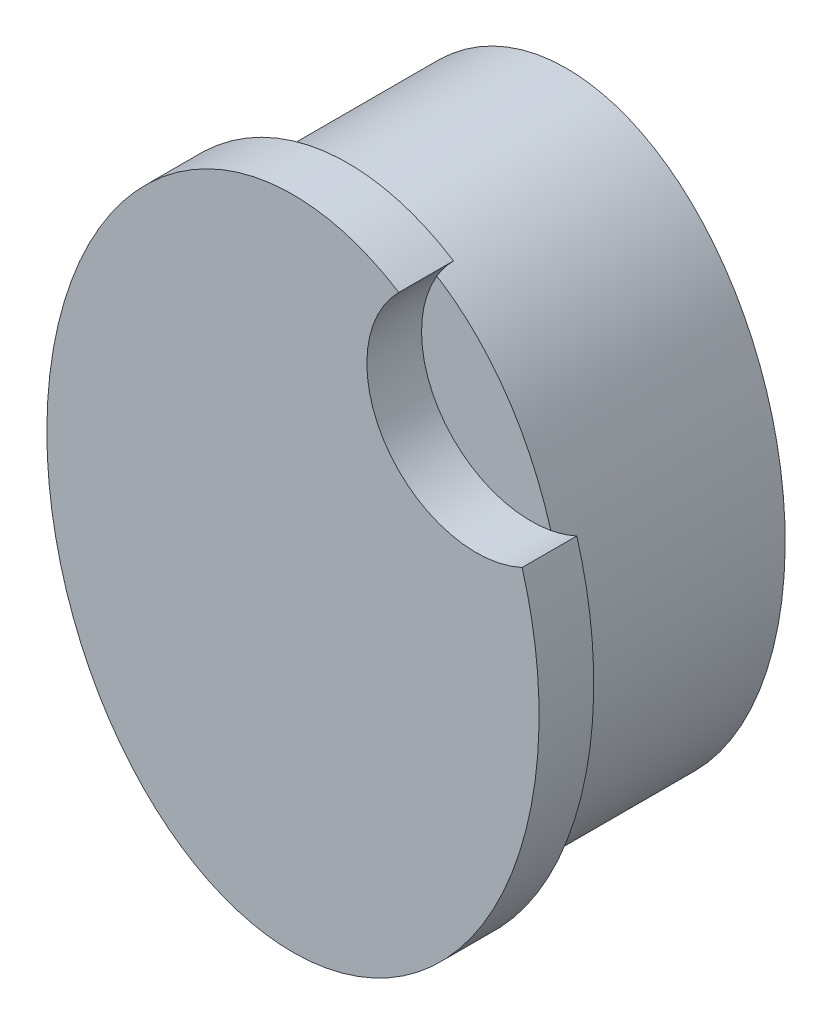
ISO-10303-21;
HEADER;
FILE_DESCRIPTION(('STEP AP214'),'2;1');
FILE_NAME('part.step','',(''),(''),'','','');
FILE_SCHEMA(('AUTOMOTIVE_DESIGN { 1 0 10303 214 1 1 1 1 }'));
ENDSEC;
DATA;
#1=APPLICATION_CONTEXT('core data for automotive mechanical design processes');
#2=APPLICATION_PROTOCOL_DEFINITION('international standard','automotive_design',2000,#1);
#3=PRODUCT_CONTEXT('',#1,'mechanical');
#4=PRODUCT('Part','Part','',(#3));
#5=PRODUCT_RELATED_PRODUCT_CATEGORY('part','',(#4));
#6=PRODUCT_DEFINITION_FORMATION('','',#4);
#7=PRODUCT_DEFINITION_CONTEXT('part definition',#1,'design');
#8=PRODUCT_DEFINITION('design','',#6,#7);
#9=PRODUCT_DEFINITION_SHAPE('','',#8);
#10=(LENGTH_UNIT() NAMED_UNIT(*) SI_UNIT(.MILLI.,.METRE.));
#11=(NAMED_UNIT(*) PLANE_ANGLE_UNIT() SI_UNIT($,.RADIAN.));
#12=(NAMED_UNIT(*) SI_UNIT($,.STERADIAN.) SOLID_ANGLE_UNIT());
#13=UNCERTAINTY_MEASURE_WITH_UNIT(LENGTH_MEASURE(1.E-05),#10,'distance_accuracy_value','');
#14=(GEOMETRIC_REPRESENTATION_CONTEXT(3) GLOBAL_UNCERTAINTY_ASSIGNED_CONTEXT((#13)) GLOBAL_UNIT_ASSIGNED_CONTEXT((#10,
#11,#12)) REPRESENTATION_CONTEXT('',''));
#15=CARTESIAN_POINT('',(0.,0.,0.));
#16=DIRECTION('',(0.,0.,1.));
#17=DIRECTION('',(1.,0.,0.));
#18=AXIS2_PLACEMENT_3D('',#15,#16,#17);
#19=CARTESIAN_POINT('',(0.,0.,8.));
#20=DIRECTION('',(0.,0.,1.));
#21=DIRECTION('',(0.,1.,0.));
#22=AXIS2_PLACEMENT_3D('',#19,#20,#21);
#23=ELLIPSE('',#22,11.,8.);
#24=DIRECTION('',(0.,0.,-1.));
#25=VECTOR('',#24,1.);
#26=SURFACE_OF_LINEAR_EXTRUSION('',#23,#25);
#27=CARTESIAN_POINT('',(7.43065525320684,4.0755154265035,8.));
#28=VERTEX_POINT('',#27);
#29=CARTESIAN_POINT('',(3.25976218449925,10.0454031857872,8.));
#30=VERTEX_POINT('',#29);
#31=EDGE_CURVE('E41',#28,#30,#23,.T.);
#32=ORIENTED_EDGE('',*,*,#31,.F.);
#33=EDGE_CURVE('E89',#30,#28,#23,.T.);
#34=ORIENTED_EDGE('',*,*,#33,.F.);
#35=EDGE_LOOP('',(#32,#34));
#36=FACE_BOUND('',#35,.T.);
#37=CARTESIAN_POINT('',(0.,0.,0.));
#38=DIRECTION('',(0.,0.,1.));
#39=DIRECTION('',(0.,1.,0.));
#40=AXIS2_PLACEMENT_3D('',#37,#38,#39);
#41=ELLIPSE('',#40,11.,8.);
#42=CARTESIAN_POINT('',(0.,11.,0.));
#43=VERTEX_POINT('',#42);
#44=EDGE_CURVE('E84',#43,#43,#41,.T.);
#45=ORIENTED_EDGE('',*,*,#44,.T.);
#46=EDGE_LOOP('',(#45));
#47=FACE_BOUND('',#46,.T.);
#48=ADVANCED_FACE('F33',(#36,#47),#26,.F.);
#49=CARTESIAN_POINT('',(0.,0.,0.));
#50=DIRECTION('',(0.,0.,1.));
#51=DIRECTION('',(1.,0.,0.));
#52=AXIS2_PLACEMENT_3D('',#49,#50,#51);
#53=PLANE('',#52);
#54=ORIENTED_EDGE('',*,*,#44,.F.);
#55=EDGE_LOOP('',(#54));
#56=FACE_BOUND('',#55,.T.);
#57=ADVANCED_FACE('F108',(#56),#53,.F.);
#58=CARTESIAN_POINT('',(0.,0.,10.));
#59=DIRECTION('',(0.,0.,1.));
#60=DIRECTION('',(0.,1.,0.));
#61=AXIS2_PLACEMENT_3D('',#58,#59,#60);
#62=ELLIPSE('',#61,12.,9.);
#63=DIRECTION('',(0.,0.,-1.));
#64=VECTOR('',#63,1.);
#65=SURFACE_OF_LINEAR_EXTRUSION('',#62,#64);
#66=CARTESIAN_POINT('',(0.,0.,8.));
#67=DIRECTION('',(0.,0.,1.));
#68=DIRECTION('',(0.,1.,0.));
#69=AXIS2_PLACEMENT_3D('',#66,#67,#68);
#70=ELLIPSE('',#69,12.,9.);
#71=CARTESIAN_POINT('',(3.870504693485,10.8336261226248,8.));
#72=VERTEX_POINT('',#71);
#73=CARTESIAN_POINT('',(8.37983667065646,4.37738376925381,8.));
#74=VERTEX_POINT('',#73);
#75=EDGE_CURVE('E78',#72,#74,#70,.T.);
#76=ORIENTED_EDGE('',*,*,#75,.T.);
#77=DIRECTION('',(0.,0.,1.));
#78=VECTOR('',#77,1.);
#79=CARTESIAN_POINT('',(8.37983667065646,4.37738376925381,8.));
#80=LINE('',#79,#78);
#81=CARTESIAN_POINT('',(8.37983667065646,4.37738376925381,10.));
#82=VERTEX_POINT('',#81);
#83=EDGE_CURVE('E48',#74,#82,#80,.T.);
#84=ORIENTED_EDGE('',*,*,#83,.T.);
#85=CARTESIAN_POINT('',(3.870504693485,10.8336261226248,10.));
#86=VERTEX_POINT('',#85);
#87=EDGE_CURVE('E80',#86,#82,#62,.T.);
#88=ORIENTED_EDGE('',*,*,#87,.F.);
#89=DIRECTION('',(0.,0.,1.));
#90=VECTOR('',#89,1.);
#91=CARTESIAN_POINT('',(3.870504693485,10.8336261226248,8.));
#92=LINE('',#91,#90);
#93=EDGE_CURVE('E66',#72,#86,#92,.T.);
#94=ORIENTED_EDGE('',*,*,#93,.F.);
#95=EDGE_LOOP('',(#76,#84,#88,#94));
#96=FACE_BOUND('',#95,.T.);
#97=ADVANCED_FACE('F77',(#96),#65,.F.);
#98=CARTESIAN_POINT('',(0.,0.,10.));
#99=DIRECTION('',(0.,0.,1.));
#100=DIRECTION('',(1.,0.,0.));
#101=AXIS2_PLACEMENT_3D('',#98,#99,#100);
#102=PLANE('',#101);
#103=CARTESIAN_POINT('',(6.70238881320191,8.00866022327396,10.));
#104=DIRECTION('',(0.,0.,1.));
#105=DIRECTION('',(1.,0.,0.));
#106=AXIS2_PLACEMENT_3D('',#103,#104,#105);
#107=CIRCLE('',#106,4.);
#108=EDGE_CURVE('E97',#86,#82,#107,.T.);
#109=ORIENTED_EDGE('',*,*,#108,.F.);
#110=ORIENTED_EDGE('',*,*,#87,.T.);
#111=EDGE_LOOP('',(#109,#110));
#112=FACE_BOUND('',#111,.T.);
#113=ADVANCED_FACE('F100',(#112),#102,.T.);
#114=CARTESIAN_POINT('',(0.,0.,8.));
#115=DIRECTION('',(0.,0.,1.));
#116=DIRECTION('',(1.,0.,0.));
#117=AXIS2_PLACEMENT_3D('',#114,#115,#116);
#118=PLANE('',#117);
#119=ORIENTED_EDGE('',*,*,#75,.F.);
#120=CARTESIAN_POINT('',(6.70238881320191,8.00866022327396,8.));
#121=DIRECTION('',(0.,0.,1.));
#122=DIRECTION('',(1.,0.,0.));
#123=AXIS2_PLACEMENT_3D('',#120,#121,#122);
#124=CIRCLE('',#123,4.);
#125=EDGE_CURVE('E63',#72,#30,#124,.T.);
#126=ORIENTED_EDGE('',*,*,#125,.T.);
#127=ORIENTED_EDGE('',*,*,#33,.T.);
#128=CARTESIAN_POINT('',(6.70238881320191,8.00866022327396,8.));
#129=DIRECTION('',(0.,0.,1.));
#130=DIRECTION('',(1.,0.,0.));
#131=AXIS2_PLACEMENT_3D('',#128,#129,#130);
#132=CIRCLE('',#131,4.);
#133=EDGE_CURVE('E11',#28,#74,#132,.T.);
#134=ORIENTED_EDGE('',*,*,#133,.T.);
#135=EDGE_LOOP('',(#119,#126,#127,#134));
#136=FACE_BOUND('',#135,.T.);
#137=ADVANCED_FACE('F82',(#136),#118,.F.);
#138=CARTESIAN_POINT('',(0.,0.,8.));
#139=DIRECTION('',(0.,0.,1.));
#140=DIRECTION('',(1.,0.,0.));
#141=AXIS2_PLACEMENT_3D('',#138,#139,#140);
#142=PLANE('',#141);
#143=ORIENTED_EDGE('',*,*,#31,.T.);
#144=EDGE_CURVE('E68',#30,#28,#124,.T.);
#145=ORIENTED_EDGE('',*,*,#144,.T.);
#146=EDGE_LOOP('',(#143,#145));
#147=FACE_BOUND('',#146,.T.);
#148=ADVANCED_FACE('F96',(#147),#142,.T.);
#149=CARTESIAN_POINT('',(6.70238881320191,8.00866022327396,8.));
#150=DIRECTION('',(0.,0.,1.));
#151=DIRECTION('',(1.,0.,0.));
#152=AXIS2_PLACEMENT_3D('',#149,#150,#151);
#153=CYLINDRICAL_SURFACE('',#152,4.);
#154=ORIENTED_EDGE('',*,*,#108,.T.);
#155=ORIENTED_EDGE('',*,*,#83,.F.);
#156=ORIENTED_EDGE('',*,*,#133,.F.);
#157=ORIENTED_EDGE('',*,*,#144,.F.);
#158=ORIENTED_EDGE('',*,*,#125,.F.);
#159=ORIENTED_EDGE('',*,*,#93,.T.);
#160=EDGE_LOOP('',(#154,#155,#156,#157,#158,#159));
#161=FACE_BOUND('',#160,.T.);
#162=ADVANCED_FACE('F65',(#161),#153,.F.);
#163=CLOSED_SHELL('',(#48,#57,#97,#113,#137,#148,#162));
#164=MANIFOLD_SOLID_BREP('B2',#163);
#165=ADVANCED_BREP_SHAPE_REPRESENTATION('',(#18,#164),#14);
#166=SHAPE_DEFINITION_REPRESENTATION(#9,#165);
ENDSEC;
END-ISO-10303-21;
